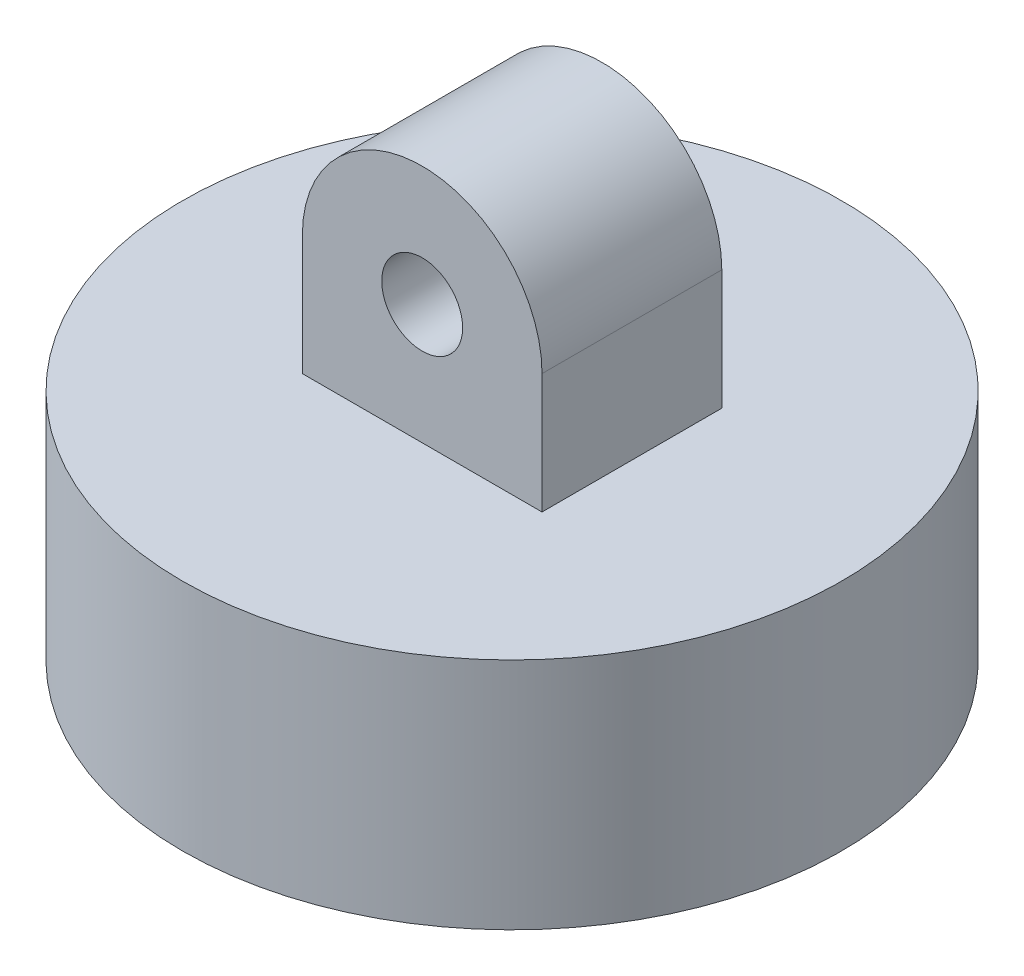
ISO-10303-21;
HEADER;
FILE_DESCRIPTION(('STEP AP214'),'2;1');
FILE_NAME('part.step','',(''),(''),'','','');
FILE_SCHEMA(('AUTOMOTIVE_DESIGN { 1 0 10303 214 1 1 1 1 }'));
ENDSEC;
DATA;
#1=APPLICATION_CONTEXT('core data for automotive mechanical design processes');
#2=APPLICATION_PROTOCOL_DEFINITION('international standard','automotive_design',2000,#1);
#3=PRODUCT_CONTEXT('',#1,'mechanical');
#4=PRODUCT('Part','Part','',(#3));
#5=PRODUCT_RELATED_PRODUCT_CATEGORY('part','',(#4));
#6=PRODUCT_DEFINITION_FORMATION('','',#4);
#7=PRODUCT_DEFINITION_CONTEXT('part definition',#1,'design');
#8=PRODUCT_DEFINITION('design','',#6,#7);
#9=PRODUCT_DEFINITION_SHAPE('','',#8);
#10=(LENGTH_UNIT() NAMED_UNIT(*) SI_UNIT(.MILLI.,.METRE.));
#11=(NAMED_UNIT(*) PLANE_ANGLE_UNIT() SI_UNIT($,.RADIAN.));
#12=(NAMED_UNIT(*) SI_UNIT($,.STERADIAN.) SOLID_ANGLE_UNIT());
#13=UNCERTAINTY_MEASURE_WITH_UNIT(LENGTH_MEASURE(1.E-05),#10,'distance_accuracy_value','');
#14=(GEOMETRIC_REPRESENTATION_CONTEXT(3) GLOBAL_UNCERTAINTY_ASSIGNED_CONTEXT((#13)) GLOBAL_UNIT_ASSIGNED_CONTEXT((#10,
#11,#12)) REPRESENTATION_CONTEXT('',''));
#15=CARTESIAN_POINT('',(0.,0.,0.));
#16=DIRECTION('',(0.,0.,1.));
#17=DIRECTION('',(1.,0.,0.));
#18=AXIS2_PLACEMENT_3D('',#15,#16,#17);
#19=CARTESIAN_POINT('',(0.,9.906,0.));
#20=DIRECTION('',(0.,1.,0.));
#21=DIRECTION('',(0.,0.,1.));
#22=AXIS2_PLACEMENT_3D('',#19,#20,#21);
#23=PLANE('',#22);
#24=CARTESIAN_POINT('',(0.,9.906,0.));
#25=DIRECTION('',(0.,1.,0.));
#26=DIRECTION('',(0.,0.,1.));
#27=AXIS2_PLACEMENT_3D('',#24,#25,#26);
#28=CIRCLE('',#27,13.97);
#29=CARTESIAN_POINT('',(0.,9.906,13.97));
#30=VERTEX_POINT('',#29);
#31=EDGE_CURVE('E113',#30,#30,#28,.T.);
#32=ORIENTED_EDGE('',*,*,#31,.T.);
#33=EDGE_LOOP('',(#32));
#34=FACE_BOUND('',#33,.T.);
#35=DIRECTION('',(1.,0.,0.));
#36=VECTOR('',#35,1.);
#37=CARTESIAN_POINT('',(5.08,9.906,-3.81));
#38=LINE('',#37,#36);
#39=CARTESIAN_POINT('',(-5.08,9.906,-3.81));
#40=VERTEX_POINT('',#39);
#41=CARTESIAN_POINT('',(5.08,9.906,-3.81));
#42=VERTEX_POINT('',#41);
#43=EDGE_CURVE('E48',#40,#42,#38,.T.);
#44=ORIENTED_EDGE('',*,*,#43,.T.);
#45=DIRECTION('',(0.,0.,-1.));
#46=VECTOR('',#45,1.);
#47=CARTESIAN_POINT('',(5.08,9.906,3.81));
#48=LINE('',#47,#46);
#49=CARTESIAN_POINT('',(5.08,9.906,3.81));
#50=VERTEX_POINT('',#49);
#51=EDGE_CURVE('E94',#50,#42,#48,.T.);
#52=ORIENTED_EDGE('',*,*,#51,.F.);
#53=DIRECTION('',(1.,0.,0.));
#54=VECTOR('',#53,1.);
#55=CARTESIAN_POINT('',(5.08,9.906,3.81));
#56=LINE('',#55,#54);
#57=CARTESIAN_POINT('',(-5.08,9.906,3.81));
#58=VERTEX_POINT('',#57);
#59=EDGE_CURVE('E88',#58,#50,#56,.T.);
#60=ORIENTED_EDGE('',*,*,#59,.F.);
#61=DIRECTION('',(0.,0.,-1.));
#62=VECTOR('',#61,1.);
#63=CARTESIAN_POINT('',(-5.08,9.906,3.81));
#64=LINE('',#63,#62);
#65=EDGE_CURVE('E99',#58,#40,#64,.T.);
#66=ORIENTED_EDGE('',*,*,#65,.T.);
#67=EDGE_LOOP('',(#44,#52,#60,#66));
#68=FACE_BOUND('',#67,.T.);
#69=ADVANCED_FACE('F33',(#34,#68),#23,.T.);
#70=CARTESIAN_POINT('',(0.,0.,0.));
#71=DIRECTION('',(0.,1.,0.));
#72=DIRECTION('',(0.,0.,1.));
#73=AXIS2_PLACEMENT_3D('',#70,#71,#72);
#74=PLANE('',#73);
#75=CARTESIAN_POINT('',(0.,0.,0.));
#76=DIRECTION('',(0.,1.,0.));
#77=DIRECTION('',(0.,0.,1.));
#78=AXIS2_PLACEMENT_3D('',#75,#76,#77);
#79=CIRCLE('',#78,13.97);
#80=CARTESIAN_POINT('',(0.,0.,13.97));
#81=VERTEX_POINT('',#80);
#82=EDGE_CURVE('E11',#81,#81,#79,.T.);
#83=ORIENTED_EDGE('',*,*,#82,.F.);
#84=EDGE_LOOP('',(#83));
#85=FACE_BOUND('',#84,.T.);
#86=CARTESIAN_POINT('',(0.,0.,0.));
#87=DIRECTION('',(0.,1.,0.));
#88=DIRECTION('',(0.,0.,1.));
#89=AXIS2_PLACEMENT_3D('',#86,#87,#88);
#90=CIRCLE('',#89,8.89);
#91=CARTESIAN_POINT('',(0.,0.,8.89));
#92=VERTEX_POINT('',#91);
#93=EDGE_CURVE('E41',#92,#92,#90,.T.);
#94=ORIENTED_EDGE('',*,*,#93,.T.);
#95=EDGE_LOOP('',(#94));
#96=FACE_BOUND('',#95,.T.);
#97=ADVANCED_FACE('F121',(#85,#96),#74,.F.);
#98=CARTESIAN_POINT('',(0.,4.826,0.));
#99=DIRECTION('',(0.,-1.,0.));
#100=DIRECTION('',(0.,0.,-1.));
#101=AXIS2_PLACEMENT_3D('',#98,#99,#100);
#102=CYLINDRICAL_SURFACE('',#101,13.97);
#103=ORIENTED_EDGE('',*,*,#82,.T.);
#104=EDGE_LOOP('',(#103));
#105=FACE_BOUND('',#104,.T.);
#106=ORIENTED_EDGE('',*,*,#31,.F.);
#107=EDGE_LOOP('',(#106));
#108=FACE_BOUND('',#107,.T.);
#109=ADVANCED_FACE('F35',(#105,#108),#102,.T.);
#110=CARTESIAN_POINT('',(0.,4.826,0.));
#111=DIRECTION('',(0.,-1.,0.));
#112=DIRECTION('',(0.,0.,-1.));
#113=AXIS2_PLACEMENT_3D('',#110,#111,#112);
#114=CYLINDRICAL_SURFACE('',#113,8.89);
#115=CARTESIAN_POINT('',(0.,4.826,0.));
#116=DIRECTION('',(0.,1.,0.));
#117=DIRECTION('',(0.,0.,1.));
#118=AXIS2_PLACEMENT_3D('',#115,#116,#117);
#119=CIRCLE('',#118,8.89);
#120=CARTESIAN_POINT('',(0.,4.826,8.89));
#121=VERTEX_POINT('',#120);
#122=EDGE_CURVE('E116',#121,#121,#119,.T.);
#123=ORIENTED_EDGE('',*,*,#122,.T.);
#124=EDGE_LOOP('',(#123));
#125=FACE_BOUND('',#124,.T.);
#126=ORIENTED_EDGE('',*,*,#93,.F.);
#127=EDGE_LOOP('',(#126));
#128=FACE_BOUND('',#127,.T.);
#129=ADVANCED_FACE('F123',(#125,#128),#114,.F.);
#130=CARTESIAN_POINT('',(0.,4.826,0.));
#131=DIRECTION('',(0.,1.,0.));
#132=DIRECTION('',(0.,0.,1.));
#133=AXIS2_PLACEMENT_3D('',#130,#131,#132);
#134=PLANE('',#133);
#135=ORIENTED_EDGE('',*,*,#122,.F.);
#136=EDGE_LOOP('',(#135));
#137=FACE_BOUND('',#136,.T.);
#138=ADVANCED_FACE('F125',(#137),#134,.F.);
#139=CARTESIAN_POINT('',(0.,14.986,3.81));
#140=DIRECTION('',(0.,0.,-1.));
#141=DIRECTION('',(-1.,0.,0.));
#142=AXIS2_PLACEMENT_3D('',#139,#140,#141);
#143=PLANE('',#142);
#144=ORIENTED_EDGE('',*,*,#59,.T.);
#145=DIRECTION('',(0.,1.,0.));
#146=VECTOR('',#145,1.);
#147=CARTESIAN_POINT('',(5.08,14.986,3.81));
#148=LINE('',#147,#146);
#149=CARTESIAN_POINT('',(5.08,14.986,3.81));
#150=VERTEX_POINT('',#149);
#151=EDGE_CURVE('E82',#50,#150,#148,.T.);
#152=ORIENTED_EDGE('',*,*,#151,.T.);
#153=CARTESIAN_POINT('',(0.,14.986,3.81));
#154=DIRECTION('',(0.,0.,1.));
#155=DIRECTION('',(-1.,0.,0.));
#156=AXIS2_PLACEMENT_3D('',#153,#154,#155);
#157=CIRCLE('',#156,5.08);
#158=CARTESIAN_POINT('',(-5.08,14.986,3.81));
#159=VERTEX_POINT('',#158);
#160=EDGE_CURVE('E86',#150,#159,#157,.T.);
#161=ORIENTED_EDGE('',*,*,#160,.T.);
#162=DIRECTION('',(0.,-1.,0.));
#163=VECTOR('',#162,1.);
#164=CARTESIAN_POINT('',(-5.08,9.906,3.81));
#165=LINE('',#164,#163);
#166=EDGE_CURVE('E57',#159,#58,#165,.T.);
#167=ORIENTED_EDGE('',*,*,#166,.T.);
#168=EDGE_LOOP('',(#144,#152,#161,#167));
#169=FACE_BOUND('',#168,.T.);
#170=CARTESIAN_POINT('',(0.,14.986,3.81));
#171=DIRECTION('',(0.,0.,1.));
#172=DIRECTION('',(1.,0.,0.));
#173=AXIS2_PLACEMENT_3D('',#170,#171,#172);
#174=CIRCLE('',#173,1.7145);
#175=CARTESIAN_POINT('',(1.7145,14.986,3.81));
#176=VERTEX_POINT('',#175);
#177=EDGE_CURVE('E104',#176,#176,#174,.T.);
#178=ORIENTED_EDGE('',*,*,#177,.F.);
#179=EDGE_LOOP('',(#178));
#180=FACE_BOUND('',#179,.T.);
#181=ADVANCED_FACE('F83',(#169,#180),#143,.F.);
#182=CARTESIAN_POINT('',(0.,14.986,-3.81));
#183=DIRECTION('',(0.,0.,-1.));
#184=DIRECTION('',(-1.,0.,0.));
#185=AXIS2_PLACEMENT_3D('',#182,#183,#184);
#186=PLANE('',#185);
#187=ORIENTED_EDGE('',*,*,#43,.F.);
#188=DIRECTION('',(0.,-1.,0.));
#189=VECTOR('',#188,1.);
#190=CARTESIAN_POINT('',(-5.08,9.906,-3.81));
#191=LINE('',#190,#189);
#192=CARTESIAN_POINT('',(-5.08,14.986,-3.81));
#193=VERTEX_POINT('',#192);
#194=EDGE_CURVE('E107',#193,#40,#191,.T.);
#195=ORIENTED_EDGE('',*,*,#194,.F.);
#196=CARTESIAN_POINT('',(0.,14.986,-3.81));
#197=DIRECTION('',(0.,0.,1.));
#198=DIRECTION('',(-1.,0.,0.));
#199=AXIS2_PLACEMENT_3D('',#196,#197,#198);
#200=CIRCLE('',#199,5.08);
#201=CARTESIAN_POINT('',(5.08,14.986,-3.81));
#202=VERTEX_POINT('',#201);
#203=EDGE_CURVE('E74',#202,#193,#200,.T.);
#204=ORIENTED_EDGE('',*,*,#203,.F.);
#205=DIRECTION('',(0.,1.,0.));
#206=VECTOR('',#205,1.);
#207=CARTESIAN_POINT('',(5.08,14.986,-3.81));
#208=LINE('',#207,#206);
#209=EDGE_CURVE('E93',#42,#202,#208,.T.);
#210=ORIENTED_EDGE('',*,*,#209,.F.);
#211=EDGE_LOOP('',(#187,#195,#204,#210));
#212=FACE_BOUND('',#211,.T.);
#213=CARTESIAN_POINT('',(0.,14.986,-3.81));
#214=DIRECTION('',(0.,0.,1.));
#215=DIRECTION('',(1.,0.,0.));
#216=AXIS2_PLACEMENT_3D('',#213,#214,#215);
#217=CIRCLE('',#216,1.7145);
#218=CARTESIAN_POINT('',(1.7145,14.986,-3.81));
#219=VERTEX_POINT('',#218);
#220=EDGE_CURVE('E167',#219,#219,#217,.T.);
#221=ORIENTED_EDGE('',*,*,#220,.T.);
#222=EDGE_LOOP('',(#221));
#223=FACE_BOUND('',#222,.T.);
#224=ADVANCED_FACE('F146',(#212,#223),#186,.T.);
#225=CARTESIAN_POINT('',(5.08,14.986,3.81));
#226=DIRECTION('',(-1.,0.,0.));
#227=DIRECTION('',(0.,-1.,0.));
#228=AXIS2_PLACEMENT_3D('',#225,#226,#227);
#229=PLANE('',#228);
#230=ORIENTED_EDGE('',*,*,#209,.T.);
#231=DIRECTION('',(0.,0.,-1.));
#232=VECTOR('',#231,1.);
#233=CARTESIAN_POINT('',(5.08,14.986,3.81));
#234=LINE('',#233,#232);
#235=EDGE_CURVE('E91',#150,#202,#234,.T.);
#236=ORIENTED_EDGE('',*,*,#235,.F.);
#237=ORIENTED_EDGE('',*,*,#151,.F.);
#238=ORIENTED_EDGE('',*,*,#51,.T.);
#239=EDGE_LOOP('',(#230,#236,#237,#238));
#240=FACE_BOUND('',#239,.T.);
#241=ADVANCED_FACE('F92',(#240),#229,.F.);
#242=CARTESIAN_POINT('',(0.,14.986,3.81));
#243=DIRECTION('',(0.,0.,-1.));
#244=DIRECTION('',(-1.,0.,0.));
#245=AXIS2_PLACEMENT_3D('',#242,#243,#244);
#246=CYLINDRICAL_SURFACE('',#245,5.08);
#247=ORIENTED_EDGE('',*,*,#203,.T.);
#248=DIRECTION('',(0.,0.,-1.));
#249=VECTOR('',#248,1.);
#250=CARTESIAN_POINT('',(-5.08,14.986,3.81));
#251=LINE('',#250,#249);
#252=EDGE_CURVE('E95',#159,#193,#251,.T.);
#253=ORIENTED_EDGE('',*,*,#252,.F.);
#254=ORIENTED_EDGE('',*,*,#160,.F.);
#255=ORIENTED_EDGE('',*,*,#235,.T.);
#256=EDGE_LOOP('',(#247,#253,#254,#255));
#257=FACE_BOUND('',#256,.T.);
#258=ADVANCED_FACE('F97',(#257),#246,.T.);
#259=CARTESIAN_POINT('',(-5.08,9.906,3.81));
#260=DIRECTION('',(1.,0.,0.));
#261=DIRECTION('',(0.,1.,0.));
#262=AXIS2_PLACEMENT_3D('',#259,#260,#261);
#263=PLANE('',#262);
#264=ORIENTED_EDGE('',*,*,#194,.T.);
#265=ORIENTED_EDGE('',*,*,#65,.F.);
#266=ORIENTED_EDGE('',*,*,#166,.F.);
#267=ORIENTED_EDGE('',*,*,#252,.T.);
#268=EDGE_LOOP('',(#264,#265,#266,#267));
#269=FACE_BOUND('',#268,.T.);
#270=ADVANCED_FACE('F149',(#269),#263,.F.);
#271=CARTESIAN_POINT('',(0.,14.986,3.81));
#272=DIRECTION('',(0.,0.,-1.));
#273=DIRECTION('',(-1.,0.,0.));
#274=AXIS2_PLACEMENT_3D('',#271,#272,#273);
#275=CYLINDRICAL_SURFACE('',#274,1.7145);
#276=ORIENTED_EDGE('',*,*,#177,.T.);
#277=EDGE_LOOP('',(#276));
#278=FACE_BOUND('',#277,.T.);
#279=ORIENTED_EDGE('',*,*,#220,.F.);
#280=EDGE_LOOP('',(#279));
#281=FACE_BOUND('',#280,.T.);
#282=ADVANCED_FACE('F152',(#278,#281),#275,.F.);
#283=CLOSED_SHELL('',(#69,#97,#109,#129,#138,#181,#224,#241,#258,#270,#282));
#284=MANIFOLD_SOLID_BREP('B2',#283);
#285=ADVANCED_BREP_SHAPE_REPRESENTATION('',(#18,#284),#14);
#286=SHAPE_DEFINITION_REPRESENTATION(#9,#285);
ENDSEC;
END-ISO-10303-21;
